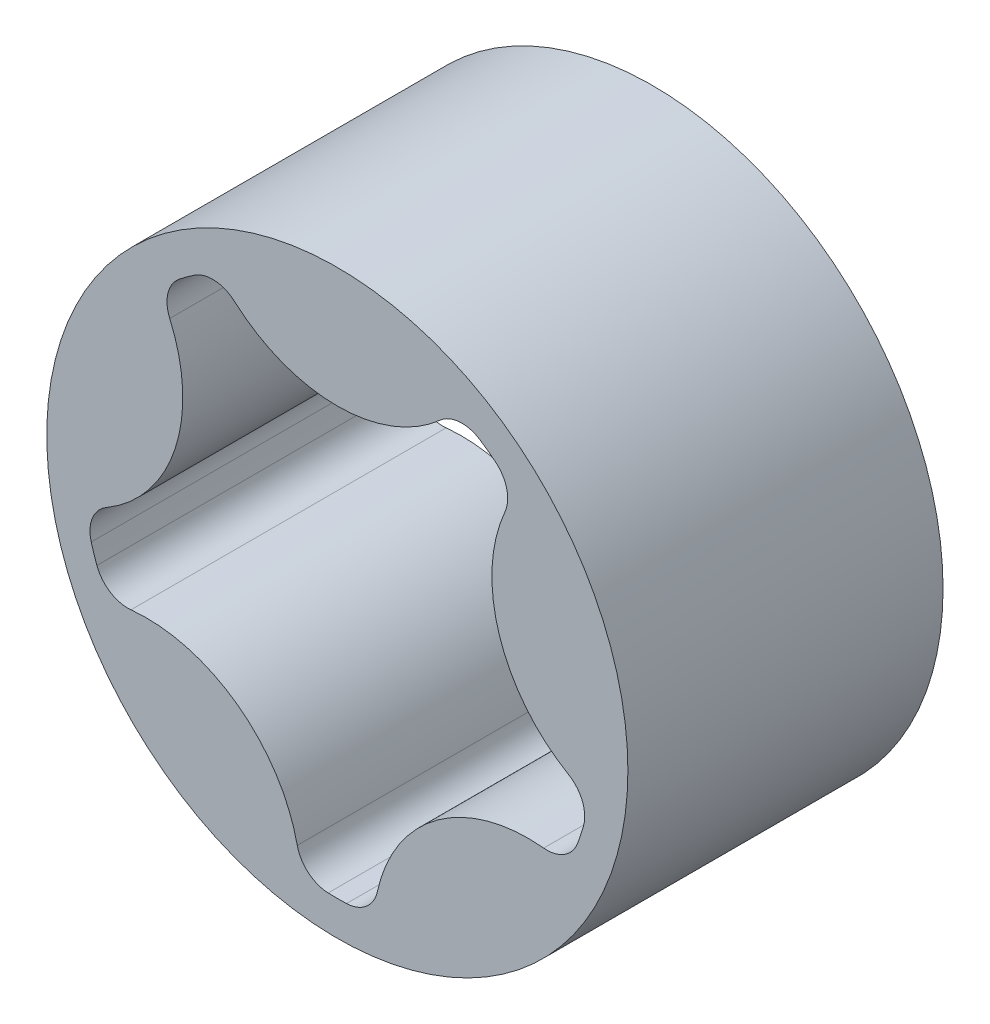
ISO-10303-21;
HEADER;
FILE_DESCRIPTION(('STEP AP214'),'2;1');
FILE_NAME('part.step','',(''),(''),'','','');
FILE_SCHEMA(('AUTOMOTIVE_DESIGN { 1 0 10303 214 1 1 1 1 }'));
ENDSEC;
DATA;
#1=APPLICATION_CONTEXT('core data for automotive mechanical design processes');
#2=APPLICATION_PROTOCOL_DEFINITION('international standard','automotive_design',2000,#1);
#3=PRODUCT_CONTEXT('',#1,'mechanical');
#4=PRODUCT('Part','Part','',(#3));
#5=PRODUCT_RELATED_PRODUCT_CATEGORY('part','',(#4));
#6=PRODUCT_DEFINITION_FORMATION('','',#4);
#7=PRODUCT_DEFINITION_CONTEXT('part definition',#1,'design');
#8=PRODUCT_DEFINITION('design','',#6,#7);
#9=PRODUCT_DEFINITION_SHAPE('','',#8);
#10=(LENGTH_UNIT() NAMED_UNIT(*) SI_UNIT(.MILLI.,.METRE.));
#11=(NAMED_UNIT(*) PLANE_ANGLE_UNIT() SI_UNIT($,.RADIAN.));
#12=(NAMED_UNIT(*) SI_UNIT($,.STERADIAN.) SOLID_ANGLE_UNIT());
#13=UNCERTAINTY_MEASURE_WITH_UNIT(LENGTH_MEASURE(1.E-05),#10,'distance_accuracy_value','');
#14=(GEOMETRIC_REPRESENTATION_CONTEXT(3) GLOBAL_UNCERTAINTY_ASSIGNED_CONTEXT((#13)) GLOBAL_UNIT_ASSIGNED_CONTEXT((#10,
#11,#12)) REPRESENTATION_CONTEXT('',''));
#15=CARTESIAN_POINT('',(0.,0.,0.));
#16=DIRECTION('',(0.,0.,1.));
#17=DIRECTION('',(1.,0.,0.));
#18=AXIS2_PLACEMENT_3D('',#15,#16,#17);
#19=CARTESIAN_POINT('',(0.,0.,21.971));
#20=DIRECTION('',(0.,0.,1.));
#21=DIRECTION('',(1.,0.,0.));
#22=AXIS2_PLACEMENT_3D('',#19,#20,#21);
#23=PLANE('',#22);
#24=CARTESIAN_POINT('',(0.,0.,21.971));
#25=DIRECTION('',(0.,0.,1.));
#26=DIRECTION('',(1.,0.,0.));
#27=AXIS2_PLACEMENT_3D('',#24,#25,#26);
#28=CIRCLE('',#27,20.2565);
#29=CARTESIAN_POINT('',(20.2565,0.,21.971));
#30=VERTEX_POINT('',#29);
#31=EDGE_CURVE('E11',#30,#30,#28,.T.);
#32=ORIENTED_EDGE('',*,*,#31,.T.);
#33=EDGE_LOOP('',(#32));
#34=FACE_BOUND('',#33,.T.);
#35=CARTESIAN_POINT('',(-21.5443594689224,7.00018673417473,21.971));
#36=DIRECTION('',(0.,0.,1.));
#37=DIRECTION('',(1.,0.,0.));
#38=AXIS2_PLACEMENT_3D('',#35,#36,#37);
#39=CIRCLE('',#38,10.7696);
#40=CARTESIAN_POINT('',(-16.1122376739657,-2.29907866502518,21.971));
#41=VERTEX_POINT('',#40);
#42=CARTESIAN_POINT('',(-11.6837095624845,11.3305293975984,21.971));
#43=VERTEX_POINT('',#42);
#44=EDGE_CURVE('E245',#41,#43,#39,.T.);
#45=ORIENTED_EDGE('',*,*,#44,.T.);
#46=CARTESIAN_POINT('',(-9.5906470823444,12.249705906344,21.971));
#47=DIRECTION('',(0.,0.,1.));
#48=DIRECTION('',(1.,0.,0.));
#49=AXIS2_PLACEMENT_3D('',#46,#47,#48);
#50=CIRCLE('',#49,2.286);
#51=CARTESIAN_POINT('',(-10.9998850209746,14.0496626925823,21.971));
#52=VERTEX_POINT('',#51);
#53=EDGE_CURVE('E175',#52,#43,#50,.T.);
#54=ORIENTED_EDGE('',*,*,#53,.F.);
#55=CARTESIAN_POINT('',(0.,0.,21.971));
#56=DIRECTION('',(0.,0.,1.));
#57=DIRECTION('',(1.,0.,0.));
#58=AXIS2_PLACEMENT_3D('',#55,#56,#57);
#59=CIRCLE('',#58,17.8435);
#60=CARTESIAN_POINT('',(-9.96287184787776,14.8030968649389,21.971));
#61=VERTEX_POINT('',#60);
#62=EDGE_CURVE('E287',#61,#52,#59,.T.);
#63=ORIENTED_EDGE('',*,*,#62,.F.);
#64=CARTESIAN_POINT('',(-8.68648968943079,12.9066147043062,21.971));
#65=DIRECTION('',(0.,0.,1.));
#66=DIRECTION('',(1.,0.,0.));
#67=AXIS2_PLACEMENT_3D('',#64,#65,#66);
#68=CIRCLE('',#67,2.286);
#69=CARTESIAN_POINT('',(-7.165509004511,14.6131942530237,21.971));
#70=VERTEX_POINT('',#69);
#71=EDGE_CURVE('E285',#70,#61,#68,.T.);
#72=ORIENTED_EDGE('',*,*,#71,.F.);
#73=CARTESIAN_POINT('',(0.,22.6530801269819,21.971));
#74=DIRECTION('',(0.,0.,1.));
#75=DIRECTION('',(1.,0.,0.));
#76=AXIS2_PLACEMENT_3D('',#73,#74,#75);
#77=CIRCLE('',#76,10.7696);
#78=CARTESIAN_POINT('',(7.165509004511,14.6131942530237,21.971));
#79=VERTEX_POINT('',#78);
#80=EDGE_CURVE('E282',#70,#79,#77,.T.);
#81=ORIENTED_EDGE('',*,*,#80,.T.);
#82=CARTESIAN_POINT('',(8.68648968943078,12.9066147043062,21.971));
#83=DIRECTION('',(0.,0.,1.));
#84=DIRECTION('',(1.,0.,0.));
#85=AXIS2_PLACEMENT_3D('',#82,#83,#84);
#86=CIRCLE('',#85,2.286);
#87=CARTESIAN_POINT('',(9.96287184787776,14.8030968649389,21.971));
#88=VERTEX_POINT('',#87);
#89=EDGE_CURVE('E280',#88,#79,#86,.T.);
#90=ORIENTED_EDGE('',*,*,#89,.F.);
#91=CARTESIAN_POINT('',(0.,0.,21.971));
#92=DIRECTION('',(0.,0.,1.));
#93=DIRECTION('',(1.,0.,0.));
#94=AXIS2_PLACEMENT_3D('',#91,#92,#93);
#95=CIRCLE('',#94,17.8435);
#96=CARTESIAN_POINT('',(10.9998850209744,14.0496626925824,21.971));
#97=VERTEX_POINT('',#96);
#98=EDGE_CURVE('E278',#97,#88,#95,.T.);
#99=ORIENTED_EDGE('',*,*,#98,.F.);
#100=CARTESIAN_POINT('',(9.59064708234423,12.2497059063441,21.971));
#101=DIRECTION('',(0.,0.,1.));
#102=DIRECTION('',(1.,0.,0.));
#103=AXIS2_PLACEMENT_3D('',#100,#101,#102);
#104=CIRCLE('',#103,2.286);
#105=CARTESIAN_POINT('',(11.6837095624844,11.3305293975986,21.971));
#106=VERTEX_POINT('',#105);
#107=EDGE_CURVE('E276',#106,#97,#104,.T.);
#108=ORIENTED_EDGE('',*,*,#107,.F.);
#109=CARTESIAN_POINT('',(21.5443594689223,7.00018673417504,21.971));
#110=DIRECTION('',(0.,0.,1.));
#111=DIRECTION('',(1.,0.,0.));
#112=AXIS2_PLACEMENT_3D('',#109,#110,#111);
#113=CIRCLE('',#112,10.7696);
#114=CARTESIAN_POINT('',(16.1122376739657,-2.29907866502496,21.971));
#115=VERTEX_POINT('',#114);
#116=EDGE_CURVE('E273',#106,#115,#113,.T.);
#117=ORIENTED_EDGE('',*,*,#116,.T.);
#118=CARTESIAN_POINT('',(14.9591929533382,-4.27297933938345,21.971));
#119=DIRECTION('',(0.,0.,1.));
#120=DIRECTION('',(1.,0.,0.));
#121=AXIS2_PLACEMENT_3D('',#118,#119,#120);
#122=CIRCLE('',#121,2.286);
#123=CARTESIAN_POINT('',(17.1572784485225,-4.90084569129285,21.971));
#124=VERTEX_POINT('',#123);
#125=EDGE_CURVE('E271',#124,#115,#122,.T.);
#126=ORIENTED_EDGE('',*,*,#125,.F.);
#127=CARTESIAN_POINT('',(0.,0.,21.971));
#128=DIRECTION('',(0.,0.,1.));
#129=DIRECTION('',(1.,0.,0.));
#130=AXIS2_PLACEMENT_3D('',#127,#128,#129);
#131=CIRCLE('',#130,17.8435);
#132=CARTESIAN_POINT('',(16.7611746631809,-6.11992779045156,21.971));
#133=VERTEX_POINT('',#132);
#134=EDGE_CURVE('E269',#133,#124,#131,.T.);
#135=ORIENTED_EDGE('',*,*,#134,.F.);
#136=CARTESIAN_POINT('',(14.6138355604247,-5.33588010199513,21.971));
#137=DIRECTION('',(0.,0.,-1.));
#138=DIRECTION('',(-1.,0.,0.));
#139=AXIS2_PLACEMENT_3D('',#136,#137,#138);
#140=CIRCLE('',#139,2.286);
#141=CARTESIAN_POINT('',(14.3864386288086,-7.6105419747779,21.971));
#142=VERTEX_POINT('',#141);
#143=EDGE_CURVE('E266',#133,#142,#140,.T.);
#144=ORIENTED_EDGE('',*,*,#143,.T.);
#145=CARTESIAN_POINT('',(13.3151464176398,-18.3267267976656,21.971));
#146=DIRECTION('',(0.,0.,1.));
#147=DIRECTION('',(1.,0.,0.));
#148=AXIS2_PLACEMENT_3D('',#145,#146,#147);
#149=CIRCLE('',#148,10.7696);
#150=CARTESIAN_POINT('',(2.79240151281649,-16.034103010819,21.971));
#151=VERTEX_POINT('',#150);
#152=EDGE_CURVE('E263',#142,#151,#149,.T.);
#153=ORIENTED_EDGE('',*,*,#152,.T.);
#154=CARTESIAN_POINT('',(0.558800000000225,-15.5474611692713,21.971));
#155=DIRECTION('',(0.,0.,-1.));
#156=DIRECTION('',(-1.,0.,0.));
#157=AXIS2_PLACEMENT_3D('',#154,#155,#156);
#158=CIRCLE('',#157,2.28599999999999);
#159=CARTESIAN_POINT('',(0.640909387755359,-17.8319860757765,21.971));
#160=VERTEX_POINT('',#159);
#161=EDGE_CURVE('E260',#151,#160,#158,.T.);
#162=ORIENTED_EDGE('',*,*,#161,.T.);
#163=CARTESIAN_POINT('',(0.,0.,21.971));
#164=DIRECTION('',(0.,0.,1.));
#165=DIRECTION('',(1.,0.,0.));
#166=AXIS2_PLACEMENT_3D('',#163,#164,#165);
#167=CIRCLE('',#166,17.8435);
#168=CARTESIAN_POINT('',(-0.640909387755121,-17.8319860757765,21.971));
#169=VERTEX_POINT('',#168);
#170=EDGE_CURVE('E258',#169,#160,#167,.T.);
#171=ORIENTED_EDGE('',*,*,#170,.F.);
#172=CARTESIAN_POINT('',(-0.558800000000006,-15.5474611692713,21.971));
#173=DIRECTION('',(0.,0.,1.));
#174=DIRECTION('',(1.,0.,0.));
#175=AXIS2_PLACEMENT_3D('',#172,#173,#174);
#176=CIRCLE('',#175,2.286);
#177=CARTESIAN_POINT('',(-2.79240151281627,-16.034103010819,21.971));
#178=VERTEX_POINT('',#177);
#179=EDGE_CURVE('E256',#178,#169,#176,.T.);
#180=ORIENTED_EDGE('',*,*,#179,.F.);
#181=CARTESIAN_POINT('',(-13.3151464176395,-18.3267267976658,21.971));
#182=DIRECTION('',(0.,0.,1.));
#183=DIRECTION('',(1.,0.,0.));
#184=AXIS2_PLACEMENT_3D('',#181,#182,#183);
#185=CIRCLE('',#184,10.7696);
#186=CARTESIAN_POINT('',(-14.3864386288085,-7.61054197477809,21.971));
#187=VERTEX_POINT('',#186);
#188=EDGE_CURVE('E253',#178,#187,#185,.T.);
#189=ORIENTED_EDGE('',*,*,#188,.T.);
#190=CARTESIAN_POINT('',(-14.6138355604246,-5.33588010199533,21.971));
#191=DIRECTION('',(0.,0.,1.));
#192=DIRECTION('',(1.,0.,0.));
#193=AXIS2_PLACEMENT_3D('',#190,#191,#192);
#194=CIRCLE('',#193,2.286);
#195=CARTESIAN_POINT('',(-16.7611746631808,-6.11992779045179,21.971));
#196=VERTEX_POINT('',#195);
#197=EDGE_CURVE('E251',#196,#187,#194,.T.);
#198=ORIENTED_EDGE('',*,*,#197,.F.);
#199=CARTESIAN_POINT('',(0.,0.,21.971));
#200=DIRECTION('',(0.,0.,1.));
#201=DIRECTION('',(1.,0.,0.));
#202=AXIS2_PLACEMENT_3D('',#199,#200,#201);
#203=CIRCLE('',#202,17.8435);
#204=CARTESIAN_POINT('',(-17.1572784485225,-4.90084569129309,21.971));
#205=VERTEX_POINT('',#204);
#206=EDGE_CURVE('E249',#205,#196,#203,.T.);
#207=ORIENTED_EDGE('',*,*,#206,.F.);
#208=CARTESIAN_POINT('',(-14.9591929533381,-4.27297933938365,21.971));
#209=DIRECTION('',(0.,0.,1.));
#210=DIRECTION('',(1.,0.,0.));
#211=AXIS2_PLACEMENT_3D('',#208,#209,#210);
#212=CIRCLE('',#211,2.286);
#213=EDGE_CURVE('E247',#41,#205,#212,.T.);
#214=ORIENTED_EDGE('',*,*,#213,.F.);
#215=EDGE_LOOP('',(#45,#54,#63,#72,#81,#90,#99,#108,#117,#126,#135,#144,#153,#162,#171,#180,
#189,#198,#207,#214));
#216=FACE_BOUND('',#215,.T.);
#217=ADVANCED_FACE('F35',(#34,#216),#23,.T.);
#218=CARTESIAN_POINT('',(0.,0.,0.));
#219=DIRECTION('',(0.,0.,1.));
#220=DIRECTION('',(1.,0.,0.));
#221=AXIS2_PLACEMENT_3D('',#218,#219,#220);
#222=PLANE('',#221);
#223=CARTESIAN_POINT('',(0.,0.,0.));
#224=DIRECTION('',(0.,0.,1.));
#225=DIRECTION('',(1.,0.,0.));
#226=AXIS2_PLACEMENT_3D('',#223,#224,#225);
#227=CIRCLE('',#226,20.2565);
#228=CARTESIAN_POINT('',(20.2565,0.,0.));
#229=VERTEX_POINT('',#228);
#230=EDGE_CURVE('E43',#229,#229,#227,.T.);
#231=ORIENTED_EDGE('',*,*,#230,.F.);
#232=EDGE_LOOP('',(#231));
#233=FACE_BOUND('',#232,.T.);
#234=CARTESIAN_POINT('',(-9.5906470823444,12.249705906344,0.));
#235=DIRECTION('',(0.,0.,1.));
#236=DIRECTION('',(1.,0.,0.));
#237=AXIS2_PLACEMENT_3D('',#234,#235,#236);
#238=CIRCLE('',#237,2.286);
#239=CARTESIAN_POINT('',(-10.9998850209746,14.0496626925823,0.));
#240=VERTEX_POINT('',#239);
#241=CARTESIAN_POINT('',(-11.6837095624845,11.3305293975984,0.));
#242=VERTEX_POINT('',#241);
#243=EDGE_CURVE('E58',#240,#242,#238,.T.);
#244=ORIENTED_EDGE('',*,*,#243,.T.);
#245=CARTESIAN_POINT('',(-21.5443594689224,7.00018673417473,0.));
#246=DIRECTION('',(0.,0.,1.));
#247=DIRECTION('',(1.,0.,0.));
#248=AXIS2_PLACEMENT_3D('',#245,#246,#247);
#249=CIRCLE('',#248,10.7696);
#250=CARTESIAN_POINT('',(-16.1122376739657,-2.29907866502518,0.));
#251=VERTEX_POINT('',#250);
#252=EDGE_CURVE('E182',#251,#242,#249,.T.);
#253=ORIENTED_EDGE('',*,*,#252,.F.);
#254=CARTESIAN_POINT('',(-14.9591929533381,-4.27297933938365,0.));
#255=DIRECTION('',(0.,0.,1.));
#256=DIRECTION('',(1.,0.,0.));
#257=AXIS2_PLACEMENT_3D('',#254,#255,#256);
#258=CIRCLE('',#257,2.286);
#259=CARTESIAN_POINT('',(-17.1572784485225,-4.90084569129309,0.));
#260=VERTEX_POINT('',#259);
#261=EDGE_CURVE('E187',#251,#260,#258,.T.);
#262=ORIENTED_EDGE('',*,*,#261,.T.);
#263=CARTESIAN_POINT('',(0.,0.,0.));
#264=DIRECTION('',(0.,0.,1.));
#265=DIRECTION('',(1.,0.,0.));
#266=AXIS2_PLACEMENT_3D('',#263,#264,#265);
#267=CIRCLE('',#266,17.8435);
#268=CARTESIAN_POINT('',(-16.7611746631808,-6.11992779045179,0.));
#269=VERTEX_POINT('',#268);
#270=EDGE_CURVE('E196',#260,#269,#267,.T.);
#271=ORIENTED_EDGE('',*,*,#270,.T.);
#272=CARTESIAN_POINT('',(-14.6138355604246,-5.33588010199533,0.));
#273=DIRECTION('',(0.,0.,1.));
#274=DIRECTION('',(1.,0.,0.));
#275=AXIS2_PLACEMENT_3D('',#272,#273,#274);
#276=CIRCLE('',#275,2.286);
#277=CARTESIAN_POINT('',(-14.3864386288085,-7.61054197477809,0.));
#278=VERTEX_POINT('',#277);
#279=EDGE_CURVE('E199',#269,#278,#276,.T.);
#280=ORIENTED_EDGE('',*,*,#279,.T.);
#281=CARTESIAN_POINT('',(-13.3151464176395,-18.3267267976658,0.));
#282=DIRECTION('',(0.,0.,1.));
#283=DIRECTION('',(1.,0.,0.));
#284=AXIS2_PLACEMENT_3D('',#281,#282,#283);
#285=CIRCLE('',#284,10.7696);
#286=CARTESIAN_POINT('',(-2.79240151281627,-16.034103010819,0.));
#287=VERTEX_POINT('',#286);
#288=EDGE_CURVE('E202',#287,#278,#285,.T.);
#289=ORIENTED_EDGE('',*,*,#288,.F.);
#290=CARTESIAN_POINT('',(-0.558800000000006,-15.5474611692713,0.));
#291=DIRECTION('',(0.,0.,1.));
#292=DIRECTION('',(1.,0.,0.));
#293=AXIS2_PLACEMENT_3D('',#290,#291,#292);
#294=CIRCLE('',#293,2.286);
#295=CARTESIAN_POINT('',(-0.640909387755121,-17.8319860757765,0.));
#296=VERTEX_POINT('',#295);
#297=EDGE_CURVE('E205',#287,#296,#294,.T.);
#298=ORIENTED_EDGE('',*,*,#297,.T.);
#299=CARTESIAN_POINT('',(0.,0.,0.));
#300=DIRECTION('',(0.,0.,1.));
#301=DIRECTION('',(1.,0.,0.));
#302=AXIS2_PLACEMENT_3D('',#299,#300,#301);
#303=CIRCLE('',#302,17.8435);
#304=CARTESIAN_POINT('',(0.640909387755359,-17.8319860757765,0.));
#305=VERTEX_POINT('',#304);
#306=EDGE_CURVE('E208',#296,#305,#303,.T.);
#307=ORIENTED_EDGE('',*,*,#306,.T.);
#308=CARTESIAN_POINT('',(0.558800000000225,-15.5474611692713,0.));
#309=DIRECTION('',(0.,0.,-1.));
#310=DIRECTION('',(-1.,0.,0.));
#311=AXIS2_PLACEMENT_3D('',#308,#309,#310);
#312=CIRCLE('',#311,2.28599999999999);
#313=CARTESIAN_POINT('',(2.79240151281649,-16.034103010819,0.));
#314=VERTEX_POINT('',#313);
#315=EDGE_CURVE('E211',#314,#305,#312,.T.);
#316=ORIENTED_EDGE('',*,*,#315,.F.);
#317=CARTESIAN_POINT('',(13.3151464176398,-18.3267267976656,0.));
#318=DIRECTION('',(0.,0.,1.));
#319=DIRECTION('',(1.,0.,0.));
#320=AXIS2_PLACEMENT_3D('',#317,#318,#319);
#321=CIRCLE('',#320,10.7696);
#322=CARTESIAN_POINT('',(14.3864386288086,-7.6105419747779,0.));
#323=VERTEX_POINT('',#322);
#324=EDGE_CURVE('E214',#323,#314,#321,.T.);
#325=ORIENTED_EDGE('',*,*,#324,.F.);
#326=CARTESIAN_POINT('',(14.6138355604247,-5.33588010199513,0.));
#327=DIRECTION('',(0.,0.,-1.));
#328=DIRECTION('',(-1.,0.,0.));
#329=AXIS2_PLACEMENT_3D('',#326,#327,#328);
#330=CIRCLE('',#329,2.286);
#331=CARTESIAN_POINT('',(16.7611746631809,-6.11992779045156,0.));
#332=VERTEX_POINT('',#331);
#333=EDGE_CURVE('E217',#332,#323,#330,.T.);
#334=ORIENTED_EDGE('',*,*,#333,.F.);
#335=CARTESIAN_POINT('',(0.,0.,0.));
#336=DIRECTION('',(0.,0.,1.));
#337=DIRECTION('',(1.,0.,0.));
#338=AXIS2_PLACEMENT_3D('',#335,#336,#337);
#339=CIRCLE('',#338,17.8435);
#340=CARTESIAN_POINT('',(17.1572784485225,-4.90084569129285,0.));
#341=VERTEX_POINT('',#340);
#342=EDGE_CURVE('E220',#332,#341,#339,.T.);
#343=ORIENTED_EDGE('',*,*,#342,.T.);
#344=CARTESIAN_POINT('',(14.9591929533382,-4.27297933938345,0.));
#345=DIRECTION('',(0.,0.,1.));
#346=DIRECTION('',(1.,0.,0.));
#347=AXIS2_PLACEMENT_3D('',#344,#345,#346);
#348=CIRCLE('',#347,2.286);
#349=CARTESIAN_POINT('',(16.1122376739657,-2.29907866502496,0.));
#350=VERTEX_POINT('',#349);
#351=EDGE_CURVE('E223',#341,#350,#348,.T.);
#352=ORIENTED_EDGE('',*,*,#351,.T.);
#353=CARTESIAN_POINT('',(21.5443594689223,7.00018673417504,0.));
#354=DIRECTION('',(0.,0.,1.));
#355=DIRECTION('',(1.,0.,0.));
#356=AXIS2_PLACEMENT_3D('',#353,#354,#355);
#357=CIRCLE('',#356,10.7696);
#358=CARTESIAN_POINT('',(11.6837095624844,11.3305293975986,0.));
#359=VERTEX_POINT('',#358);
#360=EDGE_CURVE('E226',#359,#350,#357,.T.);
#361=ORIENTED_EDGE('',*,*,#360,.F.);
#362=CARTESIAN_POINT('',(9.59064708234423,12.2497059063441,0.));
#363=DIRECTION('',(0.,0.,1.));
#364=DIRECTION('',(1.,0.,0.));
#365=AXIS2_PLACEMENT_3D('',#362,#363,#364);
#366=CIRCLE('',#365,2.286);
#367=CARTESIAN_POINT('',(10.9998850209744,14.0496626925824,0.));
#368=VERTEX_POINT('',#367);
#369=EDGE_CURVE('E229',#359,#368,#366,.T.);
#370=ORIENTED_EDGE('',*,*,#369,.T.);
#371=CARTESIAN_POINT('',(0.,0.,0.));
#372=DIRECTION('',(0.,0.,1.));
#373=DIRECTION('',(1.,0.,0.));
#374=AXIS2_PLACEMENT_3D('',#371,#372,#373);
#375=CIRCLE('',#374,17.8435);
#376=CARTESIAN_POINT('',(9.96287184787776,14.8030968649389,0.));
#377=VERTEX_POINT('',#376);
#378=EDGE_CURVE('E232',#368,#377,#375,.T.);
#379=ORIENTED_EDGE('',*,*,#378,.T.);
#380=CARTESIAN_POINT('',(8.68648968943078,12.9066147043062,0.));
#381=DIRECTION('',(0.,0.,1.));
#382=DIRECTION('',(1.,0.,0.));
#383=AXIS2_PLACEMENT_3D('',#380,#381,#382);
#384=CIRCLE('',#383,2.286);
#385=CARTESIAN_POINT('',(7.165509004511,14.6131942530237,0.));
#386=VERTEX_POINT('',#385);
#387=EDGE_CURVE('E235',#377,#386,#384,.T.);
#388=ORIENTED_EDGE('',*,*,#387,.T.);
#389=CARTESIAN_POINT('',(0.,22.6530801269819,0.));
#390=DIRECTION('',(0.,0.,1.));
#391=DIRECTION('',(1.,0.,0.));
#392=AXIS2_PLACEMENT_3D('',#389,#390,#391);
#393=CIRCLE('',#392,10.7696);
#394=CARTESIAN_POINT('',(-7.165509004511,14.6131942530237,0.));
#395=VERTEX_POINT('',#394);
#396=EDGE_CURVE('E238',#395,#386,#393,.T.);
#397=ORIENTED_EDGE('',*,*,#396,.F.);
#398=CARTESIAN_POINT('',(-8.68648968943079,12.9066147043062,0.));
#399=DIRECTION('',(0.,0.,1.));
#400=DIRECTION('',(1.,0.,0.));
#401=AXIS2_PLACEMENT_3D('',#398,#399,#400);
#402=CIRCLE('',#401,2.286);
#403=CARTESIAN_POINT('',(-9.96287184787776,14.8030968649389,0.));
#404=VERTEX_POINT('',#403);
#405=EDGE_CURVE('E241',#395,#404,#402,.T.);
#406=ORIENTED_EDGE('',*,*,#405,.T.);
#407=CARTESIAN_POINT('',(0.,0.,0.));
#408=DIRECTION('',(0.,0.,1.));
#409=DIRECTION('',(1.,0.,0.));
#410=AXIS2_PLACEMENT_3D('',#407,#408,#409);
#411=CIRCLE('',#410,17.8435);
#412=EDGE_CURVE('E192',#404,#240,#411,.T.);
#413=ORIENTED_EDGE('',*,*,#412,.T.);
#414=EDGE_LOOP('',(#244,#253,#262,#271,#280,#289,#298,#307,#316,#325,#334,#343,#352,#361,#370,
#379,#388,#397,#406,#413));
#415=FACE_BOUND('',#414,.T.);
#416=ADVANCED_FACE('F190',(#233,#415),#222,.F.);
#417=CARTESIAN_POINT('',(0.,0.,21.971));
#418=DIRECTION('',(0.,0.,-1.));
#419=DIRECTION('',(-1.,0.,0.));
#420=AXIS2_PLACEMENT_3D('',#417,#418,#419);
#421=CYLINDRICAL_SURFACE('',#420,20.2565);
#422=ORIENTED_EDGE('',*,*,#31,.F.);
#423=EDGE_LOOP('',(#422));
#424=FACE_BOUND('',#423,.T.);
#425=ORIENTED_EDGE('',*,*,#230,.T.);
#426=EDGE_LOOP('',(#425));
#427=FACE_BOUND('',#426,.T.);
#428=ADVANCED_FACE('F37',(#424,#427),#421,.T.);
#429=CARTESIAN_POINT('',(-9.5906470823444,12.249705906344,21.971));
#430=DIRECTION('',(0.,0.,-1.));
#431=DIRECTION('',(-1.,0.,0.));
#432=AXIS2_PLACEMENT_3D('',#429,#430,#431);
#433=CYLINDRICAL_SURFACE('',#432,2.286);
#434=ORIENTED_EDGE('',*,*,#243,.F.);
#435=DIRECTION('',(0.,0.,-1.));
#436=VECTOR('',#435,1.);
#437=CARTESIAN_POINT('',(-10.9998850209746,14.0496626925823,21.971));
#438=LINE('',#437,#436);
#439=EDGE_CURVE('E289',#52,#240,#438,.T.);
#440=ORIENTED_EDGE('',*,*,#439,.F.);
#441=ORIENTED_EDGE('',*,*,#53,.T.);
#442=DIRECTION('',(0.,0.,-1.));
#443=VECTOR('',#442,1.);
#444=CARTESIAN_POINT('',(-11.6837095624845,11.3305293975984,21.971));
#445=LINE('',#444,#443);
#446=EDGE_CURVE('E171',#43,#242,#445,.T.);
#447=ORIENTED_EDGE('',*,*,#446,.T.);
#448=EDGE_LOOP('',(#434,#440,#441,#447));
#449=FACE_BOUND('',#448,.T.);
#450=ADVANCED_FACE('F173',(#449),#433,.F.);
#451=CARTESIAN_POINT('',(-21.5443594689224,7.00018673417473,21.971));
#452=DIRECTION('',(0.,0.,-1.));
#453=DIRECTION('',(-1.,0.,0.));
#454=AXIS2_PLACEMENT_3D('',#451,#452,#453);
#455=CYLINDRICAL_SURFACE('',#454,10.7696);
#456=ORIENTED_EDGE('',*,*,#252,.T.);
#457=ORIENTED_EDGE('',*,*,#446,.F.);
#458=ORIENTED_EDGE('',*,*,#44,.F.);
#459=DIRECTION('',(0.,0.,-1.));
#460=VECTOR('',#459,1.);
#461=CARTESIAN_POINT('',(-16.1122376739657,-2.29907866502518,21.971));
#462=LINE('',#461,#460);
#463=EDGE_CURVE('E179',#41,#251,#462,.T.);
#464=ORIENTED_EDGE('',*,*,#463,.T.);
#465=EDGE_LOOP('',(#456,#457,#458,#464));
#466=FACE_BOUND('',#465,.T.);
#467=ADVANCED_FACE('F183',(#466),#455,.T.);
#468=CARTESIAN_POINT('',(-14.9591929533381,-4.27297933938365,21.971));
#469=DIRECTION('',(0.,0.,-1.));
#470=DIRECTION('',(-1.,0.,0.));
#471=AXIS2_PLACEMENT_3D('',#468,#469,#470);
#472=CYLINDRICAL_SURFACE('',#471,2.286);
#473=ORIENTED_EDGE('',*,*,#261,.F.);
#474=ORIENTED_EDGE('',*,*,#463,.F.);
#475=ORIENTED_EDGE('',*,*,#213,.T.);
#476=DIRECTION('',(0.,0.,-1.));
#477=VECTOR('',#476,1.);
#478=CARTESIAN_POINT('',(-17.1572784485225,-4.90084569129309,21.971));
#479=LINE('',#478,#477);
#480=EDGE_CURVE('E322',#205,#260,#479,.T.);
#481=ORIENTED_EDGE('',*,*,#480,.T.);
#482=EDGE_LOOP('',(#473,#474,#475,#481));
#483=FACE_BOUND('',#482,.T.);
#484=ADVANCED_FACE('F341',(#483),#472,.F.);
#485=CARTESIAN_POINT('',(0.,0.,21.971));
#486=DIRECTION('',(0.,0.,-1.));
#487=DIRECTION('',(-1.,0.,0.));
#488=AXIS2_PLACEMENT_3D('',#485,#486,#487);
#489=CYLINDRICAL_SURFACE('',#488,17.8435);
#490=ORIENTED_EDGE('',*,*,#270,.F.);
#491=ORIENTED_EDGE('',*,*,#480,.F.);
#492=ORIENTED_EDGE('',*,*,#206,.T.);
#493=DIRECTION('',(0.,0.,-1.));
#494=VECTOR('',#493,1.);
#495=CARTESIAN_POINT('',(-16.7611746631808,-6.11992779045179,21.971));
#496=LINE('',#495,#494);
#497=EDGE_CURVE('E320',#196,#269,#496,.T.);
#498=ORIENTED_EDGE('',*,*,#497,.T.);
#499=EDGE_LOOP('',(#490,#491,#492,#498));
#500=FACE_BOUND('',#499,.T.);
#501=ADVANCED_FACE('F344',(#500),#489,.F.);
#502=CARTESIAN_POINT('',(-14.6138355604246,-5.33588010199533,21.971));
#503=DIRECTION('',(0.,0.,-1.));
#504=DIRECTION('',(-1.,0.,0.));
#505=AXIS2_PLACEMENT_3D('',#502,#503,#504);
#506=CYLINDRICAL_SURFACE('',#505,2.286);
#507=ORIENTED_EDGE('',*,*,#279,.F.);
#508=ORIENTED_EDGE('',*,*,#497,.F.);
#509=ORIENTED_EDGE('',*,*,#197,.T.);
#510=DIRECTION('',(0.,0.,-1.));
#511=VECTOR('',#510,1.);
#512=CARTESIAN_POINT('',(-14.3864386288085,-7.61054197477809,21.971));
#513=LINE('',#512,#511);
#514=EDGE_CURVE('E318',#187,#278,#513,.T.);
#515=ORIENTED_EDGE('',*,*,#514,.T.);
#516=EDGE_LOOP('',(#507,#508,#509,#515));
#517=FACE_BOUND('',#516,.T.);
#518=ADVANCED_FACE('F348',(#517),#506,.F.);
#519=CARTESIAN_POINT('',(-13.3151464176395,-18.3267267976658,21.971));
#520=DIRECTION('',(0.,0.,-1.));
#521=DIRECTION('',(-1.,0.,0.));
#522=AXIS2_PLACEMENT_3D('',#519,#520,#521);
#523=CYLINDRICAL_SURFACE('',#522,10.7696);
#524=ORIENTED_EDGE('',*,*,#288,.T.);
#525=ORIENTED_EDGE('',*,*,#514,.F.);
#526=ORIENTED_EDGE('',*,*,#188,.F.);
#527=DIRECTION('',(0.,0.,-1.));
#528=VECTOR('',#527,1.);
#529=CARTESIAN_POINT('',(-2.79240151281627,-16.034103010819,21.971));
#530=LINE('',#529,#528);
#531=EDGE_CURVE('E316',#178,#287,#530,.T.);
#532=ORIENTED_EDGE('',*,*,#531,.T.);
#533=EDGE_LOOP('',(#524,#525,#526,#532));
#534=FACE_BOUND('',#533,.T.);
#535=ADVANCED_FACE('F352',(#534),#523,.T.);
#536=CARTESIAN_POINT('',(-0.558800000000006,-15.5474611692713,21.971));
#537=DIRECTION('',(0.,0.,-1.));
#538=DIRECTION('',(-1.,0.,0.));
#539=AXIS2_PLACEMENT_3D('',#536,#537,#538);
#540=CYLINDRICAL_SURFACE('',#539,2.286);
#541=ORIENTED_EDGE('',*,*,#297,.F.);
#542=ORIENTED_EDGE('',*,*,#531,.F.);
#543=ORIENTED_EDGE('',*,*,#179,.T.);
#544=DIRECTION('',(0.,0.,-1.));
#545=VECTOR('',#544,1.);
#546=CARTESIAN_POINT('',(-0.640909387755121,-17.8319860757765,21.971));
#547=LINE('',#546,#545);
#548=EDGE_CURVE('E314',#169,#296,#547,.T.);
#549=ORIENTED_EDGE('',*,*,#548,.T.);
#550=EDGE_LOOP('',(#541,#542,#543,#549));
#551=FACE_BOUND('',#550,.T.);
#552=ADVANCED_FACE('F356',(#551),#540,.F.);
#553=CARTESIAN_POINT('',(0.,0.,21.971));
#554=DIRECTION('',(0.,0.,-1.));
#555=DIRECTION('',(-1.,0.,0.));
#556=AXIS2_PLACEMENT_3D('',#553,#554,#555);
#557=CYLINDRICAL_SURFACE('',#556,17.8435);
#558=ORIENTED_EDGE('',*,*,#306,.F.);
#559=ORIENTED_EDGE('',*,*,#548,.F.);
#560=ORIENTED_EDGE('',*,*,#170,.T.);
#561=DIRECTION('',(0.,0.,-1.));
#562=VECTOR('',#561,1.);
#563=CARTESIAN_POINT('',(0.640909387755359,-17.8319860757765,21.971));
#564=LINE('',#563,#562);
#565=EDGE_CURVE('E312',#160,#305,#564,.T.);
#566=ORIENTED_EDGE('',*,*,#565,.T.);
#567=EDGE_LOOP('',(#558,#559,#560,#566));
#568=FACE_BOUND('',#567,.T.);
#569=ADVANCED_FACE('F360',(#568),#557,.F.);
#570=CARTESIAN_POINT('',(0.558800000000225,-15.5474611692713,21.971));
#571=DIRECTION('',(0.,0.,-1.));
#572=DIRECTION('',(-1.,0.,0.));
#573=AXIS2_PLACEMENT_3D('',#570,#571,#572);
#574=CYLINDRICAL_SURFACE('',#573,2.28599999999999);
#575=ORIENTED_EDGE('',*,*,#315,.T.);
#576=ORIENTED_EDGE('',*,*,#565,.F.);
#577=ORIENTED_EDGE('',*,*,#161,.F.);
#578=DIRECTION('',(0.,0.,-1.));
#579=VECTOR('',#578,1.);
#580=CARTESIAN_POINT('',(2.79240151281649,-16.034103010819,21.971));
#581=LINE('',#580,#579);
#582=EDGE_CURVE('E310',#151,#314,#581,.T.);
#583=ORIENTED_EDGE('',*,*,#582,.T.);
#584=EDGE_LOOP('',(#575,#576,#577,#583));
#585=FACE_BOUND('',#584,.T.);
#586=ADVANCED_FACE('F364',(#585),#574,.F.);
#587=CARTESIAN_POINT('',(13.3151464176398,-18.3267267976656,21.971));
#588=DIRECTION('',(0.,0.,-1.));
#589=DIRECTION('',(-1.,0.,0.));
#590=AXIS2_PLACEMENT_3D('',#587,#588,#589);
#591=CYLINDRICAL_SURFACE('',#590,10.7696);
#592=ORIENTED_EDGE('',*,*,#324,.T.);
#593=ORIENTED_EDGE('',*,*,#582,.F.);
#594=ORIENTED_EDGE('',*,*,#152,.F.);
#595=DIRECTION('',(0.,0.,-1.));
#596=VECTOR('',#595,1.);
#597=CARTESIAN_POINT('',(14.3864386288086,-7.6105419747779,21.971));
#598=LINE('',#597,#596);
#599=EDGE_CURVE('E308',#142,#323,#598,.T.);
#600=ORIENTED_EDGE('',*,*,#599,.T.);
#601=EDGE_LOOP('',(#592,#593,#594,#600));
#602=FACE_BOUND('',#601,.T.);
#603=ADVANCED_FACE('F368',(#602),#591,.T.);
#604=CARTESIAN_POINT('',(14.6138355604247,-5.33588010199513,21.971));
#605=DIRECTION('',(0.,0.,-1.));
#606=DIRECTION('',(-1.,0.,0.));
#607=AXIS2_PLACEMENT_3D('',#604,#605,#606);
#608=CYLINDRICAL_SURFACE('',#607,2.286);
#609=ORIENTED_EDGE('',*,*,#333,.T.);
#610=ORIENTED_EDGE('',*,*,#599,.F.);
#611=ORIENTED_EDGE('',*,*,#143,.F.);
#612=DIRECTION('',(0.,0.,-1.));
#613=VECTOR('',#612,1.);
#614=CARTESIAN_POINT('',(16.7611746631809,-6.11992779045156,21.971));
#615=LINE('',#614,#613);
#616=EDGE_CURVE('E306',#133,#332,#615,.T.);
#617=ORIENTED_EDGE('',*,*,#616,.T.);
#618=EDGE_LOOP('',(#609,#610,#611,#617));
#619=FACE_BOUND('',#618,.T.);
#620=ADVANCED_FACE('F372',(#619),#608,.F.);
#621=CARTESIAN_POINT('',(0.,0.,21.971));
#622=DIRECTION('',(0.,0.,-1.));
#623=DIRECTION('',(-1.,0.,0.));
#624=AXIS2_PLACEMENT_3D('',#621,#622,#623);
#625=CYLINDRICAL_SURFACE('',#624,17.8435);
#626=ORIENTED_EDGE('',*,*,#342,.F.);
#627=ORIENTED_EDGE('',*,*,#616,.F.);
#628=ORIENTED_EDGE('',*,*,#134,.T.);
#629=DIRECTION('',(0.,0.,-1.));
#630=VECTOR('',#629,1.);
#631=CARTESIAN_POINT('',(17.1572784485225,-4.90084569129285,21.971));
#632=LINE('',#631,#630);
#633=EDGE_CURVE('E304',#124,#341,#632,.T.);
#634=ORIENTED_EDGE('',*,*,#633,.T.);
#635=EDGE_LOOP('',(#626,#627,#628,#634));
#636=FACE_BOUND('',#635,.T.);
#637=ADVANCED_FACE('F376',(#636),#625,.F.);
#638=CARTESIAN_POINT('',(14.9591929533382,-4.27297933938345,21.971));
#639=DIRECTION('',(0.,0.,-1.));
#640=DIRECTION('',(-1.,0.,0.));
#641=AXIS2_PLACEMENT_3D('',#638,#639,#640);
#642=CYLINDRICAL_SURFACE('',#641,2.286);
#643=ORIENTED_EDGE('',*,*,#351,.F.);
#644=ORIENTED_EDGE('',*,*,#633,.F.);
#645=ORIENTED_EDGE('',*,*,#125,.T.);
#646=DIRECTION('',(0.,0.,-1.));
#647=VECTOR('',#646,1.);
#648=CARTESIAN_POINT('',(16.1122376739657,-2.29907866502496,21.971));
#649=LINE('',#648,#647);
#650=EDGE_CURVE('E302',#115,#350,#649,.T.);
#651=ORIENTED_EDGE('',*,*,#650,.T.);
#652=EDGE_LOOP('',(#643,#644,#645,#651));
#653=FACE_BOUND('',#652,.T.);
#654=ADVANCED_FACE('F380',(#653),#642,.F.);
#655=CARTESIAN_POINT('',(21.5443594689223,7.00018673417504,21.971));
#656=DIRECTION('',(0.,0.,-1.));
#657=DIRECTION('',(-1.,0.,0.));
#658=AXIS2_PLACEMENT_3D('',#655,#656,#657);
#659=CYLINDRICAL_SURFACE('',#658,10.7696);
#660=ORIENTED_EDGE('',*,*,#360,.T.);
#661=ORIENTED_EDGE('',*,*,#650,.F.);
#662=ORIENTED_EDGE('',*,*,#116,.F.);
#663=DIRECTION('',(0.,0.,-1.));
#664=VECTOR('',#663,1.);
#665=CARTESIAN_POINT('',(11.6837095624844,11.3305293975986,21.971));
#666=LINE('',#665,#664);
#667=EDGE_CURVE('E300',#106,#359,#666,.T.);
#668=ORIENTED_EDGE('',*,*,#667,.T.);
#669=EDGE_LOOP('',(#660,#661,#662,#668));
#670=FACE_BOUND('',#669,.T.);
#671=ADVANCED_FACE('F384',(#670),#659,.T.);
#672=CARTESIAN_POINT('',(9.59064708234423,12.2497059063441,21.971));
#673=DIRECTION('',(0.,0.,-1.));
#674=DIRECTION('',(-1.,0.,0.));
#675=AXIS2_PLACEMENT_3D('',#672,#673,#674);
#676=CYLINDRICAL_SURFACE('',#675,2.286);
#677=ORIENTED_EDGE('',*,*,#369,.F.);
#678=ORIENTED_EDGE('',*,*,#667,.F.);
#679=ORIENTED_EDGE('',*,*,#107,.T.);
#680=DIRECTION('',(0.,0.,-1.));
#681=VECTOR('',#680,1.);
#682=CARTESIAN_POINT('',(10.9998850209744,14.0496626925824,21.971));
#683=LINE('',#682,#681);
#684=EDGE_CURVE('E298',#97,#368,#683,.T.);
#685=ORIENTED_EDGE('',*,*,#684,.T.);
#686=EDGE_LOOP('',(#677,#678,#679,#685));
#687=FACE_BOUND('',#686,.T.);
#688=ADVANCED_FACE('F388',(#687),#676,.F.);
#689=CARTESIAN_POINT('',(0.,0.,21.971));
#690=DIRECTION('',(0.,0.,-1.));
#691=DIRECTION('',(-1.,0.,0.));
#692=AXIS2_PLACEMENT_3D('',#689,#690,#691);
#693=CYLINDRICAL_SURFACE('',#692,17.8435);
#694=ORIENTED_EDGE('',*,*,#378,.F.);
#695=ORIENTED_EDGE('',*,*,#684,.F.);
#696=ORIENTED_EDGE('',*,*,#98,.T.);
#697=DIRECTION('',(0.,0.,-1.));
#698=VECTOR('',#697,1.);
#699=CARTESIAN_POINT('',(9.96287184787776,14.8030968649389,21.971));
#700=LINE('',#699,#698);
#701=EDGE_CURVE('E296',#88,#377,#700,.T.);
#702=ORIENTED_EDGE('',*,*,#701,.T.);
#703=EDGE_LOOP('',(#694,#695,#696,#702));
#704=FACE_BOUND('',#703,.T.);
#705=ADVANCED_FACE('F392',(#704),#693,.F.);
#706=CARTESIAN_POINT('',(8.68648968943078,12.9066147043062,21.971));
#707=DIRECTION('',(0.,0.,-1.));
#708=DIRECTION('',(-1.,0.,0.));
#709=AXIS2_PLACEMENT_3D('',#706,#707,#708);
#710=CYLINDRICAL_SURFACE('',#709,2.286);
#711=ORIENTED_EDGE('',*,*,#387,.F.);
#712=ORIENTED_EDGE('',*,*,#701,.F.);
#713=ORIENTED_EDGE('',*,*,#89,.T.);
#714=DIRECTION('',(0.,0.,-1.));
#715=VECTOR('',#714,1.);
#716=CARTESIAN_POINT('',(7.165509004511,14.6131942530237,21.971));
#717=LINE('',#716,#715);
#718=EDGE_CURVE('E294',#79,#386,#717,.T.);
#719=ORIENTED_EDGE('',*,*,#718,.T.);
#720=EDGE_LOOP('',(#711,#712,#713,#719));
#721=FACE_BOUND('',#720,.T.);
#722=ADVANCED_FACE('F396',(#721),#710,.F.);
#723=CARTESIAN_POINT('',(0.,22.6530801269819,21.971));
#724=DIRECTION('',(0.,0.,-1.));
#725=DIRECTION('',(-1.,0.,0.));
#726=AXIS2_PLACEMENT_3D('',#723,#724,#725);
#727=CYLINDRICAL_SURFACE('',#726,10.7696);
#728=ORIENTED_EDGE('',*,*,#396,.T.);
#729=ORIENTED_EDGE('',*,*,#718,.F.);
#730=ORIENTED_EDGE('',*,*,#80,.F.);
#731=DIRECTION('',(0.,0.,-1.));
#732=VECTOR('',#731,1.);
#733=CARTESIAN_POINT('',(-7.165509004511,14.6131942530237,21.971));
#734=LINE('',#733,#732);
#735=EDGE_CURVE('E292',#70,#395,#734,.T.);
#736=ORIENTED_EDGE('',*,*,#735,.T.);
#737=EDGE_LOOP('',(#728,#729,#730,#736));
#738=FACE_BOUND('',#737,.T.);
#739=ADVANCED_FACE('F400',(#738),#727,.T.);
#740=CARTESIAN_POINT('',(-8.68648968943079,12.9066147043062,21.971));
#741=DIRECTION('',(0.,0.,-1.));
#742=DIRECTION('',(-1.,0.,0.));
#743=AXIS2_PLACEMENT_3D('',#740,#741,#742);
#744=CYLINDRICAL_SURFACE('',#743,2.286);
#745=ORIENTED_EDGE('',*,*,#405,.F.);
#746=ORIENTED_EDGE('',*,*,#735,.F.);
#747=ORIENTED_EDGE('',*,*,#71,.T.);
#748=DIRECTION('',(0.,0.,-1.));
#749=VECTOR('',#748,1.);
#750=CARTESIAN_POINT('',(-9.96287184787776,14.8030968649389,21.971));
#751=LINE('',#750,#749);
#752=EDGE_CURVE('E50',#61,#404,#751,.T.);
#753=ORIENTED_EDGE('',*,*,#752,.T.);
#754=EDGE_LOOP('',(#745,#746,#747,#753));
#755=FACE_BOUND('',#754,.T.);
#756=ADVANCED_FACE('F404',(#755),#744,.F.);
#757=CARTESIAN_POINT('',(0.,0.,21.971));
#758=DIRECTION('',(0.,0.,-1.));
#759=DIRECTION('',(-1.,0.,0.));
#760=AXIS2_PLACEMENT_3D('',#757,#758,#759);
#761=CYLINDRICAL_SURFACE('',#760,17.8435);
#762=ORIENTED_EDGE('',*,*,#412,.F.);
#763=ORIENTED_EDGE('',*,*,#752,.F.);
#764=ORIENTED_EDGE('',*,*,#62,.T.);
#765=ORIENTED_EDGE('',*,*,#439,.T.);
#766=EDGE_LOOP('',(#762,#763,#764,#765));
#767=FACE_BOUND('',#766,.T.);
#768=ADVANCED_FACE('F408',(#767),#761,.F.);
#769=CLOSED_SHELL('',(#217,#416,#428,#450,#467,#484,#501,#518,#535,#552,#569,#586,#603,#620,
#637,#654,#671,#688,#705,#722,#739,#756,#768));
#770=MANIFOLD_SOLID_BREP('B2',#769);
#771=ADVANCED_BREP_SHAPE_REPRESENTATION('',(#18,#770),#14);
#772=SHAPE_DEFINITION_REPRESENTATION(#9,#771);
ENDSEC;
END-ISO-10303-21;
